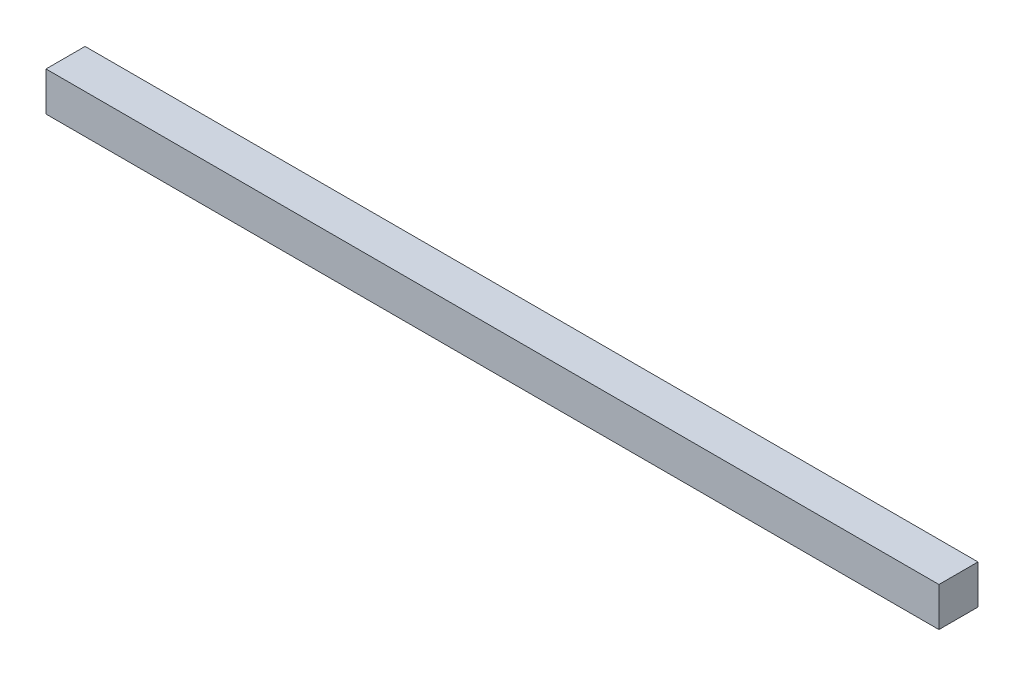
ISO-10303-21;
HEADER;
FILE_DESCRIPTION(('STEP AP214'),'2;1');
FILE_NAME('part.step','',(''),(''),'','','');
FILE_SCHEMA(('AUTOMOTIVE_DESIGN { 1 0 10303 214 1 1 1 1 }'));
ENDSEC;
DATA;
#1=APPLICATION_CONTEXT('core data for automotive mechanical design processes');
#2=APPLICATION_PROTOCOL_DEFINITION('international standard','automotive_design',2000,#1);
#3=PRODUCT_CONTEXT('',#1,'mechanical');
#4=PRODUCT('Part','Part','',(#3));
#5=PRODUCT_RELATED_PRODUCT_CATEGORY('part','',(#4));
#6=PRODUCT_DEFINITION_FORMATION('','',#4);
#7=PRODUCT_DEFINITION_CONTEXT('part definition',#1,'design');
#8=PRODUCT_DEFINITION('design','',#6,#7);
#9=PRODUCT_DEFINITION_SHAPE('','',#8);
#10=(LENGTH_UNIT() NAMED_UNIT(*) SI_UNIT(.MILLI.,.METRE.));
#11=(NAMED_UNIT(*) PLANE_ANGLE_UNIT() SI_UNIT($,.RADIAN.));
#12=(NAMED_UNIT(*) SI_UNIT($,.STERADIAN.) SOLID_ANGLE_UNIT());
#13=UNCERTAINTY_MEASURE_WITH_UNIT(LENGTH_MEASURE(1.E-05),#10,'distance_accuracy_value','');
#14=(GEOMETRIC_REPRESENTATION_CONTEXT(3) GLOBAL_UNCERTAINTY_ASSIGNED_CONTEXT((#13)) GLOBAL_UNIT_ASSIGNED_CONTEXT((#10,
#11,#12)) REPRESENTATION_CONTEXT('',''));
#15=CARTESIAN_POINT('',(0.,0.,0.));
#16=DIRECTION('',(0.,0.,1.));
#17=DIRECTION('',(1.,0.,0.));
#18=AXIS2_PLACEMENT_3D('',#15,#16,#17);
#19=CARTESIAN_POINT('',(-114.265,10.,-4.99999999999999));
#20=DIRECTION('',(1.,0.,0.));
#21=DIRECTION('',(0.,0.,-1.));
#22=AXIS2_PLACEMENT_3D('',#19,#20,#21);
#23=PLANE('',#22);
#24=DIRECTION('',(0.,0.,1.));
#25=VECTOR('',#24,1.);
#26=CARTESIAN_POINT('',(-114.265,0.,-4.99999999999999));
#27=LINE('',#26,#25);
#28=CARTESIAN_POINT('',(-114.265,0.,-4.99999999999999));
#29=VERTEX_POINT('',#28);
#30=CARTESIAN_POINT('',(-114.265,0.,5.00000000000001));
#31=VERTEX_POINT('',#30);
#32=EDGE_CURVE('E96',#29,#31,#27,.T.);
#33=ORIENTED_EDGE('',*,*,#32,.T.);
#34=DIRECTION('',(0.,-1.,0.));
#35=VECTOR('',#34,1.);
#36=CARTESIAN_POINT('',(-114.265,10.,5.00000000000001));
#37=LINE('',#36,#35);
#38=CARTESIAN_POINT('',(-114.265,10.,5.00000000000001));
#39=VERTEX_POINT('',#38);
#40=EDGE_CURVE('E11',#39,#31,#37,.T.);
#41=ORIENTED_EDGE('',*,*,#40,.F.);
#42=DIRECTION('',(0.,0.,1.));
#43=VECTOR('',#42,1.);
#44=CARTESIAN_POINT('',(-114.265,10.,-4.99999999999999));
#45=LINE('',#44,#43);
#46=CARTESIAN_POINT('',(-114.265,10.,-4.99999999999999));
#47=VERTEX_POINT('',#46);
#48=EDGE_CURVE('E84',#47,#39,#45,.T.);
#49=ORIENTED_EDGE('',*,*,#48,.F.);
#50=DIRECTION('',(0.,-1.,0.));
#51=VECTOR('',#50,1.);
#52=CARTESIAN_POINT('',(-114.265,10.,-4.99999999999999));
#53=LINE('',#52,#51);
#54=EDGE_CURVE('E92',#47,#29,#53,.T.);
#55=ORIENTED_EDGE('',*,*,#54,.T.);
#56=EDGE_LOOP('',(#33,#41,#49,#55));
#57=FACE_BOUND('',#56,.T.);
#58=ADVANCED_FACE('F33',(#57),#23,.F.);
#59=CARTESIAN_POINT('',(-114.265,10.,5.00000000000001));
#60=DIRECTION('',(0.,0.,-1.));
#61=DIRECTION('',(-1.,0.,0.));
#62=AXIS2_PLACEMENT_3D('',#59,#60,#61);
#63=PLANE('',#62);
#64=DIRECTION('',(1.,0.,0.));
#65=VECTOR('',#64,1.);
#66=CARTESIAN_POINT('',(-114.265,0.,5.00000000000001));
#67=LINE('',#66,#65);
#68=CARTESIAN_POINT('',(114.265,0.,5.00000000000001));
#69=VERTEX_POINT('',#68);
#70=EDGE_CURVE('E88',#31,#69,#67,.T.);
#71=ORIENTED_EDGE('',*,*,#70,.T.);
#72=DIRECTION('',(0.,-1.,0.));
#73=VECTOR('',#72,1.);
#74=CARTESIAN_POINT('',(114.265,10.,5.00000000000001));
#75=LINE('',#74,#73);
#76=CARTESIAN_POINT('',(114.265,10.,5.00000000000001));
#77=VERTEX_POINT('',#76);
#78=EDGE_CURVE('E41',#77,#69,#75,.T.);
#79=ORIENTED_EDGE('',*,*,#78,.F.);
#80=DIRECTION('',(1.,0.,0.));
#81=VECTOR('',#80,1.);
#82=CARTESIAN_POINT('',(-114.265,10.,5.00000000000001));
#83=LINE('',#82,#81);
#84=EDGE_CURVE('E79',#39,#77,#83,.T.);
#85=ORIENTED_EDGE('',*,*,#84,.F.);
#86=ORIENTED_EDGE('',*,*,#40,.T.);
#87=EDGE_LOOP('',(#71,#79,#85,#86));
#88=FACE_BOUND('',#87,.T.);
#89=ADVANCED_FACE('F87',(#88),#63,.F.);
#90=CARTESIAN_POINT('',(114.265,10.,-4.99999999999999));
#91=DIRECTION('',(-1.,0.,0.));
#92=DIRECTION('',(0.,0.,1.));
#93=AXIS2_PLACEMENT_3D('',#90,#91,#92);
#94=PLANE('',#93);
#95=DIRECTION('',(0.,0.,-1.));
#96=VECTOR('',#95,1.);
#97=CARTESIAN_POINT('',(114.265,0.,-4.99999999999999));
#98=LINE('',#97,#96);
#99=CARTESIAN_POINT('',(114.265,0.,-4.99999999999999));
#100=VERTEX_POINT('',#99);
#101=EDGE_CURVE('E66',#69,#100,#98,.T.);
#102=ORIENTED_EDGE('',*,*,#101,.T.);
#103=DIRECTION('',(0.,-1.,0.));
#104=VECTOR('',#103,1.);
#105=CARTESIAN_POINT('',(114.265,10.,-4.99999999999999));
#106=LINE('',#105,#104);
#107=CARTESIAN_POINT('',(114.265,10.,-4.99999999999999));
#108=VERTEX_POINT('',#107);
#109=EDGE_CURVE('E89',#108,#100,#106,.T.);
#110=ORIENTED_EDGE('',*,*,#109,.F.);
#111=DIRECTION('',(0.,0.,-1.));
#112=VECTOR('',#111,1.);
#113=CARTESIAN_POINT('',(114.265,10.,-4.99999999999999));
#114=LINE('',#113,#112);
#115=EDGE_CURVE('E82',#77,#108,#114,.T.);
#116=ORIENTED_EDGE('',*,*,#115,.F.);
#117=ORIENTED_EDGE('',*,*,#78,.T.);
#118=EDGE_LOOP('',(#102,#110,#116,#117));
#119=FACE_BOUND('',#118,.T.);
#120=ADVANCED_FACE('F90',(#119),#94,.F.);
#121=CARTESIAN_POINT('',(-114.265,10.,-4.99999999999999));
#122=DIRECTION('',(0.,0.,1.));
#123=DIRECTION('',(1.,0.,0.));
#124=AXIS2_PLACEMENT_3D('',#121,#122,#123);
#125=PLANE('',#124);
#126=DIRECTION('',(-1.,0.,0.));
#127=VECTOR('',#126,1.);
#128=CARTESIAN_POINT('',(-114.265,0.,-4.99999999999999));
#129=LINE('',#128,#127);
#130=EDGE_CURVE('E72',#100,#29,#129,.T.);
#131=ORIENTED_EDGE('',*,*,#130,.T.);
#132=ORIENTED_EDGE('',*,*,#54,.F.);
#133=DIRECTION('',(-1.,0.,0.));
#134=VECTOR('',#133,1.);
#135=CARTESIAN_POINT('',(-114.265,10.,-4.99999999999999));
#136=LINE('',#135,#134);
#137=EDGE_CURVE('E49',#108,#47,#136,.T.);
#138=ORIENTED_EDGE('',*,*,#137,.F.);
#139=ORIENTED_EDGE('',*,*,#109,.T.);
#140=EDGE_LOOP('',(#131,#132,#138,#139));
#141=FACE_BOUND('',#140,.T.);
#142=ADVANCED_FACE('F103',(#141),#125,.F.);
#143=CARTESIAN_POINT('',(0.,10.,0.));
#144=DIRECTION('',(0.,1.,0.));
#145=DIRECTION('',(0.,0.,1.));
#146=AXIS2_PLACEMENT_3D('',#143,#144,#145);
#147=PLANE('',#146);
#148=ORIENTED_EDGE('',*,*,#48,.T.);
#149=ORIENTED_EDGE('',*,*,#84,.T.);
#150=ORIENTED_EDGE('',*,*,#115,.T.);
#151=ORIENTED_EDGE('',*,*,#137,.T.);
#152=EDGE_LOOP('',(#148,#149,#150,#151));
#153=FACE_BOUND('',#152,.T.);
#154=ADVANCED_FACE('F80',(#153),#147,.T.);
#155=CARTESIAN_POINT('',(0.,0.,0.));
#156=DIRECTION('',(0.,1.,0.));
#157=DIRECTION('',(0.,0.,1.));
#158=AXIS2_PLACEMENT_3D('',#155,#156,#157);
#159=PLANE('',#158);
#160=ORIENTED_EDGE('',*,*,#32,.F.);
#161=ORIENTED_EDGE('',*,*,#130,.F.);
#162=ORIENTED_EDGE('',*,*,#101,.F.);
#163=ORIENTED_EDGE('',*,*,#70,.F.);
#164=EDGE_LOOP('',(#160,#161,#162,#163));
#165=FACE_BOUND('',#164,.T.);
#166=ADVANCED_FACE('F106',(#165),#159,.F.);
#167=CLOSED_SHELL('',(#58,#89,#120,#142,#154,#166));
#168=MANIFOLD_SOLID_BREP('B2',#167);
#169=ADVANCED_BREP_SHAPE_REPRESENTATION('',(#18,#168),#14);
#170=SHAPE_DEFINITION_REPRESENTATION(#9,#169);
ENDSEC;
END-ISO-10303-21;
